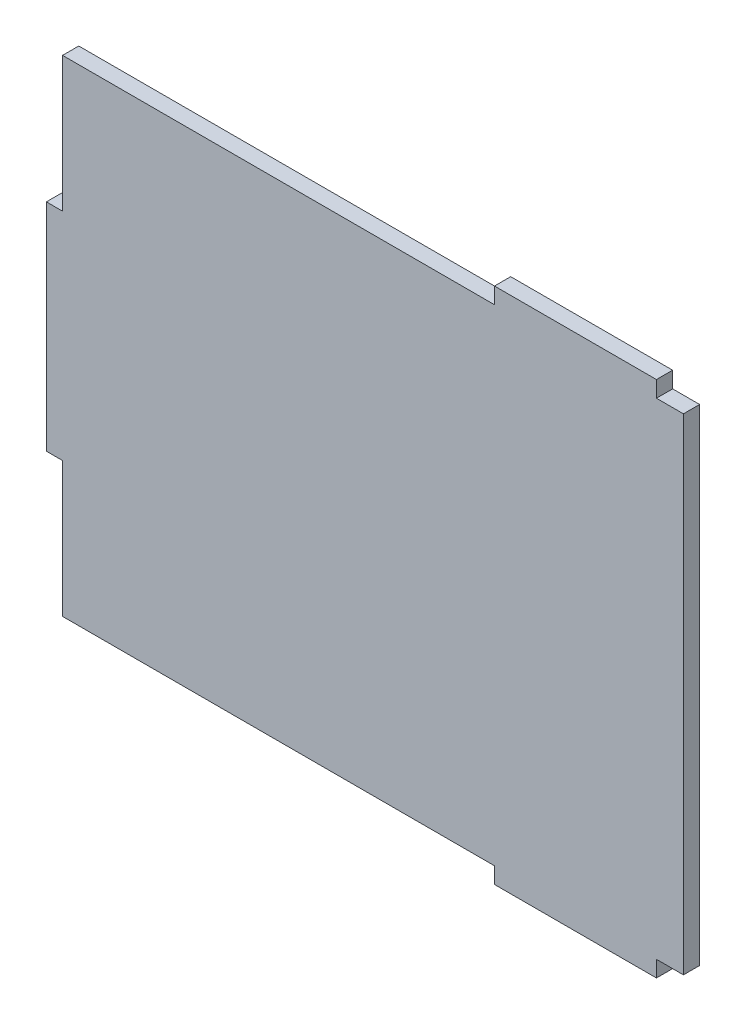
ISO-10303-21;
HEADER;
FILE_DESCRIPTION(('STEP AP214'),'2;1');
FILE_NAME('part.step','',(''),(''),'','','');
FILE_SCHEMA(('AUTOMOTIVE_DESIGN { 1 0 10303 214 1 1 1 1 }'));
ENDSEC;
DATA;
#1=APPLICATION_CONTEXT('core data for automotive mechanical design processes');
#2=APPLICATION_PROTOCOL_DEFINITION('international standard','automotive_design',2000,#1);
#3=PRODUCT_CONTEXT('',#1,'mechanical');
#4=PRODUCT('Part','Part','',(#3));
#5=PRODUCT_RELATED_PRODUCT_CATEGORY('part','',(#4));
#6=PRODUCT_DEFINITION_FORMATION('','',#4);
#7=PRODUCT_DEFINITION_CONTEXT('part definition',#1,'design');
#8=PRODUCT_DEFINITION('design','',#6,#7);
#9=PRODUCT_DEFINITION_SHAPE('','',#8);
#10=(LENGTH_UNIT() NAMED_UNIT(*) SI_UNIT(.MILLI.,.METRE.));
#11=(NAMED_UNIT(*) PLANE_ANGLE_UNIT() SI_UNIT($,.RADIAN.));
#12=(NAMED_UNIT(*) SI_UNIT($,.STERADIAN.) SOLID_ANGLE_UNIT());
#13=UNCERTAINTY_MEASURE_WITH_UNIT(LENGTH_MEASURE(1.E-05),#10,'distance_accuracy_value','');
#14=(GEOMETRIC_REPRESENTATION_CONTEXT(3) GLOBAL_UNCERTAINTY_ASSIGNED_CONTEXT((#13)) GLOBAL_UNIT_ASSIGNED_CONTEXT((#10,
#11,#12)) REPRESENTATION_CONTEXT('',''));
#15=CARTESIAN_POINT('',(0.,0.,0.));
#16=DIRECTION('',(0.,0.,1.));
#17=DIRECTION('',(1.,0.,0.));
#18=AXIS2_PLACEMENT_3D('',#15,#16,#17);
#19=CARTESIAN_POINT('',(22.5,-45.,3.));
#20=DIRECTION('',(0.,1.,0.));
#21=DIRECTION('',(-1.,0.,0.));
#22=AXIS2_PLACEMENT_3D('',#19,#20,#21);
#23=PLANE('',#22);
#24=DIRECTION('',(1.,0.,0.));
#25=VECTOR('',#24,1.);
#26=CARTESIAN_POINT('',(22.5,-45.,0.));
#27=LINE('',#26,#25);
#28=CARTESIAN_POINT('',(-57.5,-45.,0.));
#29=VERTEX_POINT('',#28);
#30=CARTESIAN_POINT('',(22.5,-45.,0.));
#31=VERTEX_POINT('',#30);
#32=EDGE_CURVE('E177',#29,#31,#27,.T.);
#33=ORIENTED_EDGE('',*,*,#32,.T.);
#34=DIRECTION('',(0.,0.,-1.));
#35=VECTOR('',#34,1.);
#36=CARTESIAN_POINT('',(22.5,-45.,3.));
#37=LINE('',#36,#35);
#38=CARTESIAN_POINT('',(22.5,-45.,3.));
#39=VERTEX_POINT('',#38);
#40=EDGE_CURVE('E11',#39,#31,#37,.T.);
#41=ORIENTED_EDGE('',*,*,#40,.F.);
#42=DIRECTION('',(1.,0.,0.));
#43=VECTOR('',#42,1.);
#44=CARTESIAN_POINT('',(22.5,-45.,3.));
#45=LINE('',#44,#43);
#46=CARTESIAN_POINT('',(-57.5,-45.,3.));
#47=VERTEX_POINT('',#46);
#48=EDGE_CURVE('E207',#47,#39,#45,.T.);
#49=ORIENTED_EDGE('',*,*,#48,.F.);
#50=DIRECTION('',(0.,0.,-1.));
#51=VECTOR('',#50,1.);
#52=CARTESIAN_POINT('',(-57.5,-45.,3.));
#53=LINE('',#52,#51);
#54=EDGE_CURVE('E173',#47,#29,#53,.T.);
#55=ORIENTED_EDGE('',*,*,#54,.T.);
#56=EDGE_LOOP('',(#33,#41,#49,#55));
#57=FACE_BOUND('',#56,.T.);
#58=ADVANCED_FACE('F33',(#57),#23,.F.);
#59=CARTESIAN_POINT('',(22.5,-48.,3.));
#60=DIRECTION('',(1.,0.,0.));
#61=DIRECTION('',(0.,0.,-1.));
#62=AXIS2_PLACEMENT_3D('',#59,#60,#61);
#63=PLANE('',#62);
#64=DIRECTION('',(0.,-1.,0.));
#65=VECTOR('',#64,1.);
#66=CARTESIAN_POINT('',(22.5,-48.,0.));
#67=LINE('',#66,#65);
#68=CARTESIAN_POINT('',(22.5,-48.,0.));
#69=VERTEX_POINT('',#68);
#70=EDGE_CURVE('E180',#31,#69,#67,.T.);
#71=ORIENTED_EDGE('',*,*,#70,.T.);
#72=DIRECTION('',(0.,0.,-1.));
#73=VECTOR('',#72,1.);
#74=CARTESIAN_POINT('',(22.5,-48.,3.));
#75=LINE('',#74,#73);
#76=CARTESIAN_POINT('',(22.5,-48.,3.));
#77=VERTEX_POINT('',#76);
#78=EDGE_CURVE('E41',#77,#69,#75,.T.);
#79=ORIENTED_EDGE('',*,*,#78,.F.);
#80=DIRECTION('',(0.,-1.,0.));
#81=VECTOR('',#80,1.);
#82=CARTESIAN_POINT('',(22.5,-48.,3.));
#83=LINE('',#82,#81);
#84=EDGE_CURVE('E116',#39,#77,#83,.T.);
#85=ORIENTED_EDGE('',*,*,#84,.F.);
#86=ORIENTED_EDGE('',*,*,#40,.T.);
#87=EDGE_LOOP('',(#71,#79,#85,#86));
#88=FACE_BOUND('',#87,.T.);
#89=ADVANCED_FACE('F305',(#88),#63,.F.);
#90=CARTESIAN_POINT('',(22.5,-48.,3.));
#91=DIRECTION('',(0.,1.,0.));
#92=DIRECTION('',(0.,0.,1.));
#93=AXIS2_PLACEMENT_3D('',#90,#91,#92);
#94=PLANE('',#93);
#95=DIRECTION('',(1.,0.,0.));
#96=VECTOR('',#95,1.);
#97=CARTESIAN_POINT('',(22.5,-48.,0.));
#98=LINE('',#97,#96);
#99=CARTESIAN_POINT('',(52.5,-48.,0.));
#100=VERTEX_POINT('',#99);
#101=EDGE_CURVE('E182',#69,#100,#98,.T.);
#102=ORIENTED_EDGE('',*,*,#101,.T.);
#103=DIRECTION('',(0.,0.,-1.));
#104=VECTOR('',#103,1.);
#105=CARTESIAN_POINT('',(52.5,-48.,3.));
#106=LINE('',#105,#104);
#107=CARTESIAN_POINT('',(52.5,-48.,3.));
#108=VERTEX_POINT('',#107);
#109=EDGE_CURVE('E238',#108,#100,#106,.T.);
#110=ORIENTED_EDGE('',*,*,#109,.F.);
#111=DIRECTION('',(1.,0.,0.));
#112=VECTOR('',#111,1.);
#113=CARTESIAN_POINT('',(22.5,-48.,3.));
#114=LINE('',#113,#112);
#115=EDGE_CURVE('E246',#77,#108,#114,.T.);
#116=ORIENTED_EDGE('',*,*,#115,.F.);
#117=ORIENTED_EDGE('',*,*,#78,.T.);
#118=EDGE_LOOP('',(#102,#110,#116,#117));
#119=FACE_BOUND('',#118,.T.);
#120=ADVANCED_FACE('F244',(#119),#94,.F.);
#121=CARTESIAN_POINT('',(52.5,-48.,3.));
#122=DIRECTION('',(-1.,0.,0.));
#123=DIRECTION('',(0.,0.,1.));
#124=AXIS2_PLACEMENT_3D('',#121,#122,#123);
#125=PLANE('',#124);
#126=DIRECTION('',(0.,1.,0.));
#127=VECTOR('',#126,1.);
#128=CARTESIAN_POINT('',(52.5,-48.,0.));
#129=LINE('',#128,#127);
#130=CARTESIAN_POINT('',(52.5,-45.,0.));
#131=VERTEX_POINT('',#130);
#132=EDGE_CURVE('E184',#100,#131,#129,.T.);
#133=ORIENTED_EDGE('',*,*,#132,.T.);
#134=DIRECTION('',(0.,0.,-1.));
#135=VECTOR('',#134,1.);
#136=CARTESIAN_POINT('',(52.5,-45.,3.));
#137=LINE('',#136,#135);
#138=CARTESIAN_POINT('',(52.5,-45.,3.));
#139=VERTEX_POINT('',#138);
#140=EDGE_CURVE('E235',#139,#131,#137,.T.);
#141=ORIENTED_EDGE('',*,*,#140,.F.);
#142=DIRECTION('',(0.,1.,0.));
#143=VECTOR('',#142,1.);
#144=CARTESIAN_POINT('',(52.5,-48.,3.));
#145=LINE('',#144,#143);
#146=EDGE_CURVE('E264',#108,#139,#145,.T.);
#147=ORIENTED_EDGE('',*,*,#146,.F.);
#148=ORIENTED_EDGE('',*,*,#109,.T.);
#149=EDGE_LOOP('',(#133,#141,#147,#148));
#150=FACE_BOUND('',#149,.T.);
#151=ADVANCED_FACE('F255',(#150),#125,.F.);
#152=CARTESIAN_POINT('',(57.5,-45.,3.));
#153=DIRECTION('',(0.,1.,0.));
#154=DIRECTION('',(0.,0.,1.));
#155=AXIS2_PLACEMENT_3D('',#152,#153,#154);
#156=PLANE('',#155);
#157=DIRECTION('',(1.,0.,0.));
#158=VECTOR('',#157,1.);
#159=CARTESIAN_POINT('',(57.5,-45.,0.));
#160=LINE('',#159,#158);
#161=CARTESIAN_POINT('',(57.5,-45.,0.));
#162=VERTEX_POINT('',#161);
#163=EDGE_CURVE('E186',#131,#162,#160,.T.);
#164=ORIENTED_EDGE('',*,*,#163,.T.);
#165=DIRECTION('',(0.,0.,-1.));
#166=VECTOR('',#165,1.);
#167=CARTESIAN_POINT('',(57.5,-45.,3.));
#168=LINE('',#167,#166);
#169=CARTESIAN_POINT('',(57.5,-45.,3.));
#170=VERTEX_POINT('',#169);
#171=EDGE_CURVE('E232',#170,#162,#168,.T.);
#172=ORIENTED_EDGE('',*,*,#171,.F.);
#173=DIRECTION('',(1.,0.,0.));
#174=VECTOR('',#173,1.);
#175=CARTESIAN_POINT('',(57.5,-45.,3.));
#176=LINE('',#175,#174);
#177=EDGE_CURVE('E261',#139,#170,#176,.T.);
#178=ORIENTED_EDGE('',*,*,#177,.F.);
#179=ORIENTED_EDGE('',*,*,#140,.T.);
#180=EDGE_LOOP('',(#164,#172,#178,#179));
#181=FACE_BOUND('',#180,.T.);
#182=ADVANCED_FACE('F259',(#181),#156,.F.);
#183=CARTESIAN_POINT('',(57.5,45.,3.));
#184=DIRECTION('',(-1.,0.,0.));
#185=DIRECTION('',(0.,-1.,0.));
#186=AXIS2_PLACEMENT_3D('',#183,#184,#185);
#187=PLANE('',#186);
#188=DIRECTION('',(0.,1.,0.));
#189=VECTOR('',#188,1.);
#190=CARTESIAN_POINT('',(57.5,45.,0.));
#191=LINE('',#190,#189);
#192=CARTESIAN_POINT('',(57.5,45.,0.));
#193=VERTEX_POINT('',#192);
#194=EDGE_CURVE('E188',#162,#193,#191,.T.);
#195=ORIENTED_EDGE('',*,*,#194,.T.);
#196=DIRECTION('',(0.,0.,-1.));
#197=VECTOR('',#196,1.);
#198=CARTESIAN_POINT('',(57.5,45.,3.));
#199=LINE('',#198,#197);
#200=CARTESIAN_POINT('',(57.5,45.,3.));
#201=VERTEX_POINT('',#200);
#202=EDGE_CURVE('E229',#201,#193,#199,.T.);
#203=ORIENTED_EDGE('',*,*,#202,.F.);
#204=DIRECTION('',(0.,1.,0.));
#205=VECTOR('',#204,1.);
#206=CARTESIAN_POINT('',(57.5,45.,3.));
#207=LINE('',#206,#205);
#208=EDGE_CURVE('E263',#170,#201,#207,.T.);
#209=ORIENTED_EDGE('',*,*,#208,.F.);
#210=ORIENTED_EDGE('',*,*,#171,.T.);
#211=EDGE_LOOP('',(#195,#203,#209,#210));
#212=FACE_BOUND('',#211,.T.);
#213=ADVANCED_FACE('F318',(#212),#187,.F.);
#214=CARTESIAN_POINT('',(57.5,45.,3.));
#215=DIRECTION('',(0.,-1.,0.));
#216=DIRECTION('',(0.,0.,-1.));
#217=AXIS2_PLACEMENT_3D('',#214,#215,#216);
#218=PLANE('',#217);
#219=DIRECTION('',(-1.,0.,0.));
#220=VECTOR('',#219,1.);
#221=CARTESIAN_POINT('',(57.5,45.,0.));
#222=LINE('',#221,#220);
#223=CARTESIAN_POINT('',(52.5,45.,0.));
#224=VERTEX_POINT('',#223);
#225=EDGE_CURVE('E190',#193,#224,#222,.T.);
#226=ORIENTED_EDGE('',*,*,#225,.T.);
#227=DIRECTION('',(0.,0.,-1.));
#228=VECTOR('',#227,1.);
#229=CARTESIAN_POINT('',(52.5,45.,3.));
#230=LINE('',#229,#228);
#231=CARTESIAN_POINT('',(52.5,45.,3.));
#232=VERTEX_POINT('',#231);
#233=EDGE_CURVE('E226',#232,#224,#230,.T.);
#234=ORIENTED_EDGE('',*,*,#233,.F.);
#235=DIRECTION('',(-1.,0.,0.));
#236=VECTOR('',#235,1.);
#237=CARTESIAN_POINT('',(57.5,45.,3.));
#238=LINE('',#237,#236);
#239=EDGE_CURVE('E266',#201,#232,#238,.T.);
#240=ORIENTED_EDGE('',*,*,#239,.F.);
#241=ORIENTED_EDGE('',*,*,#202,.T.);
#242=EDGE_LOOP('',(#226,#234,#240,#241));
#243=FACE_BOUND('',#242,.T.);
#244=ADVANCED_FACE('F321',(#243),#218,.F.);
#245=CARTESIAN_POINT('',(52.5,45.,3.));
#246=DIRECTION('',(-1.,0.,0.));
#247=DIRECTION('',(0.,-1.,0.));
#248=AXIS2_PLACEMENT_3D('',#245,#246,#247);
#249=PLANE('',#248);
#250=DIRECTION('',(0.,1.,0.));
#251=VECTOR('',#250,1.);
#252=CARTESIAN_POINT('',(52.5,45.,0.));
#253=LINE('',#252,#251);
#254=CARTESIAN_POINT('',(52.5,48.,0.));
#255=VERTEX_POINT('',#254);
#256=EDGE_CURVE('E192',#224,#255,#253,.T.);
#257=ORIENTED_EDGE('',*,*,#256,.T.);
#258=DIRECTION('',(0.,0.,-1.));
#259=VECTOR('',#258,1.);
#260=CARTESIAN_POINT('',(52.5,48.,3.));
#261=LINE('',#260,#259);
#262=CARTESIAN_POINT('',(52.5,48.,3.));
#263=VERTEX_POINT('',#262);
#264=EDGE_CURVE('E223',#263,#255,#261,.T.);
#265=ORIENTED_EDGE('',*,*,#264,.F.);
#266=DIRECTION('',(0.,1.,0.));
#267=VECTOR('',#266,1.);
#268=CARTESIAN_POINT('',(52.5,45.,3.));
#269=LINE('',#268,#267);
#270=EDGE_CURVE('E272',#232,#263,#269,.T.);
#271=ORIENTED_EDGE('',*,*,#270,.F.);
#272=ORIENTED_EDGE('',*,*,#233,.T.);
#273=EDGE_LOOP('',(#257,#265,#271,#272));
#274=FACE_BOUND('',#273,.T.);
#275=ADVANCED_FACE('F325',(#274),#249,.F.);
#276=CARTESIAN_POINT('',(22.5,48.,3.));
#277=DIRECTION('',(0.,-1.,0.));
#278=DIRECTION('',(0.,0.,-1.));
#279=AXIS2_PLACEMENT_3D('',#276,#277,#278);
#280=PLANE('',#279);
#281=DIRECTION('',(-1.,0.,0.));
#282=VECTOR('',#281,1.);
#283=CARTESIAN_POINT('',(22.5,48.,0.));
#284=LINE('',#283,#282);
#285=CARTESIAN_POINT('',(22.5,48.,0.));
#286=VERTEX_POINT('',#285);
#287=EDGE_CURVE('E194',#255,#286,#284,.T.);
#288=ORIENTED_EDGE('',*,*,#287,.T.);
#289=DIRECTION('',(0.,0.,-1.));
#290=VECTOR('',#289,1.);
#291=CARTESIAN_POINT('',(22.5,48.,3.));
#292=LINE('',#291,#290);
#293=CARTESIAN_POINT('',(22.5,48.,3.));
#294=VERTEX_POINT('',#293);
#295=EDGE_CURVE('E220',#294,#286,#292,.T.);
#296=ORIENTED_EDGE('',*,*,#295,.F.);
#297=DIRECTION('',(-1.,0.,0.));
#298=VECTOR('',#297,1.);
#299=CARTESIAN_POINT('',(22.5,48.,3.));
#300=LINE('',#299,#298);
#301=EDGE_CURVE('E274',#263,#294,#300,.T.);
#302=ORIENTED_EDGE('',*,*,#301,.F.);
#303=ORIENTED_EDGE('',*,*,#264,.T.);
#304=EDGE_LOOP('',(#288,#296,#302,#303));
#305=FACE_BOUND('',#304,.T.);
#306=ADVANCED_FACE('F329',(#305),#280,.F.);
#307=CARTESIAN_POINT('',(22.5,45.,3.));
#308=DIRECTION('',(1.,0.,0.));
#309=DIRECTION('',(0.,0.,-1.));
#310=AXIS2_PLACEMENT_3D('',#307,#308,#309);
#311=PLANE('',#310);
#312=DIRECTION('',(0.,-1.,0.));
#313=VECTOR('',#312,1.);
#314=CARTESIAN_POINT('',(22.5,45.,0.));
#315=LINE('',#314,#313);
#316=CARTESIAN_POINT('',(22.5,45.,0.));
#317=VERTEX_POINT('',#316);
#318=EDGE_CURVE('E196',#286,#317,#315,.T.);
#319=ORIENTED_EDGE('',*,*,#318,.T.);
#320=DIRECTION('',(0.,0.,-1.));
#321=VECTOR('',#320,1.);
#322=CARTESIAN_POINT('',(22.5,45.,3.));
#323=LINE('',#322,#321);
#324=CARTESIAN_POINT('',(22.5,45.,3.));
#325=VERTEX_POINT('',#324);
#326=EDGE_CURVE('E217',#325,#317,#323,.T.);
#327=ORIENTED_EDGE('',*,*,#326,.F.);
#328=DIRECTION('',(0.,-1.,0.));
#329=VECTOR('',#328,1.);
#330=CARTESIAN_POINT('',(22.5,45.,3.));
#331=LINE('',#330,#329);
#332=EDGE_CURVE('E276',#294,#325,#331,.T.);
#333=ORIENTED_EDGE('',*,*,#332,.F.);
#334=ORIENTED_EDGE('',*,*,#295,.T.);
#335=EDGE_LOOP('',(#319,#327,#333,#334));
#336=FACE_BOUND('',#335,.T.);
#337=ADVANCED_FACE('F333',(#336),#311,.F.);
#338=CARTESIAN_POINT('',(22.5,45.,3.));
#339=DIRECTION('',(0.,-1.,0.));
#340=DIRECTION('',(0.,0.,-1.));
#341=AXIS2_PLACEMENT_3D('',#338,#339,#340);
#342=PLANE('',#341);
#343=DIRECTION('',(-1.,0.,0.));
#344=VECTOR('',#343,1.);
#345=CARTESIAN_POINT('',(22.5,45.,0.));
#346=LINE('',#345,#344);
#347=CARTESIAN_POINT('',(-57.5,45.,0.));
#348=VERTEX_POINT('',#347);
#349=EDGE_CURVE('E198',#317,#348,#346,.T.);
#350=ORIENTED_EDGE('',*,*,#349,.T.);
#351=DIRECTION('',(0.,0.,-1.));
#352=VECTOR('',#351,1.);
#353=CARTESIAN_POINT('',(-57.5,45.,3.));
#354=LINE('',#353,#352);
#355=CARTESIAN_POINT('',(-57.5,45.,3.));
#356=VERTEX_POINT('',#355);
#357=EDGE_CURVE('E214',#356,#348,#354,.T.);
#358=ORIENTED_EDGE('',*,*,#357,.F.);
#359=DIRECTION('',(-1.,0.,0.));
#360=VECTOR('',#359,1.);
#361=CARTESIAN_POINT('',(22.5,45.,3.));
#362=LINE('',#361,#360);
#363=EDGE_CURVE('E278',#325,#356,#362,.T.);
#364=ORIENTED_EDGE('',*,*,#363,.F.);
#365=ORIENTED_EDGE('',*,*,#326,.T.);
#366=EDGE_LOOP('',(#350,#358,#364,#365));
#367=FACE_BOUND('',#366,.T.);
#368=ADVANCED_FACE('F337',(#367),#342,.F.);
#369=CARTESIAN_POINT('',(-57.5,45.,3.));
#370=DIRECTION('',(1.,0.,0.));
#371=DIRECTION('',(0.,1.,0.));
#372=AXIS2_PLACEMENT_3D('',#369,#370,#371);
#373=PLANE('',#372);
#374=DIRECTION('',(0.,-1.,0.));
#375=VECTOR('',#374,1.);
#376=CARTESIAN_POINT('',(-57.5,45.,0.));
#377=LINE('',#376,#375);
#378=CARTESIAN_POINT('',(-57.5,20.,0.));
#379=VERTEX_POINT('',#378);
#380=EDGE_CURVE('E200',#348,#379,#377,.T.);
#381=ORIENTED_EDGE('',*,*,#380,.T.);
#382=DIRECTION('',(0.,0.,-1.));
#383=VECTOR('',#382,1.);
#384=CARTESIAN_POINT('',(-57.5,20.,3.));
#385=LINE('',#384,#383);
#386=CARTESIAN_POINT('',(-57.5,20.,3.));
#387=VERTEX_POINT('',#386);
#388=EDGE_CURVE('E211',#387,#379,#385,.T.);
#389=ORIENTED_EDGE('',*,*,#388,.F.);
#390=DIRECTION('',(0.,-1.,0.));
#391=VECTOR('',#390,1.);
#392=CARTESIAN_POINT('',(-57.5,45.,3.));
#393=LINE('',#392,#391);
#394=EDGE_CURVE('E280',#356,#387,#393,.T.);
#395=ORIENTED_EDGE('',*,*,#394,.F.);
#396=ORIENTED_EDGE('',*,*,#357,.T.);
#397=EDGE_LOOP('',(#381,#389,#395,#396));
#398=FACE_BOUND('',#397,.T.);
#399=ADVANCED_FACE('F286',(#398),#373,.F.);
#400=CARTESIAN_POINT('',(-60.5,20.,3.));
#401=DIRECTION('',(0.,-1.,0.));
#402=DIRECTION('',(0.,0.,-1.));
#403=AXIS2_PLACEMENT_3D('',#400,#401,#402);
#404=PLANE('',#403);
#405=DIRECTION('',(-1.,0.,0.));
#406=VECTOR('',#405,1.);
#407=CARTESIAN_POINT('',(-60.5,20.,0.));
#408=LINE('',#407,#406);
#409=CARTESIAN_POINT('',(-60.5,20.,0.));
#410=VERTEX_POINT('',#409);
#411=EDGE_CURVE('E202',#379,#410,#408,.T.);
#412=ORIENTED_EDGE('',*,*,#411,.T.);
#413=DIRECTION('',(0.,0.,-1.));
#414=VECTOR('',#413,1.);
#415=CARTESIAN_POINT('',(-60.5,20.,3.));
#416=LINE('',#415,#414);
#417=CARTESIAN_POINT('',(-60.5,20.,3.));
#418=VERTEX_POINT('',#417);
#419=EDGE_CURVE('E168',#418,#410,#416,.T.);
#420=ORIENTED_EDGE('',*,*,#419,.F.);
#421=DIRECTION('',(-1.,0.,0.));
#422=VECTOR('',#421,1.);
#423=CARTESIAN_POINT('',(-60.5,20.,3.));
#424=LINE('',#423,#422);
#425=EDGE_CURVE('E159',#387,#418,#424,.T.);
#426=ORIENTED_EDGE('',*,*,#425,.F.);
#427=ORIENTED_EDGE('',*,*,#388,.T.);
#428=EDGE_LOOP('',(#412,#420,#426,#427));
#429=FACE_BOUND('',#428,.T.);
#430=ADVANCED_FACE('F290',(#429),#404,.F.);
#431=CARTESIAN_POINT('',(-60.5,-20.,3.));
#432=DIRECTION('',(1.,0.,0.));
#433=DIRECTION('',(0.,0.,-1.));
#434=AXIS2_PLACEMENT_3D('',#431,#432,#433);
#435=PLANE('',#434);
#436=DIRECTION('',(0.,-1.,0.));
#437=VECTOR('',#436,1.);
#438=CARTESIAN_POINT('',(-60.5,-20.,0.));
#439=LINE('',#438,#437);
#440=CARTESIAN_POINT('',(-60.5,-20.,0.));
#441=VERTEX_POINT('',#440);
#442=EDGE_CURVE('E167',#410,#441,#439,.T.);
#443=ORIENTED_EDGE('',*,*,#442,.T.);
#444=DIRECTION('',(0.,0.,-1.));
#445=VECTOR('',#444,1.);
#446=CARTESIAN_POINT('',(-60.5,-20.,3.));
#447=LINE('',#446,#445);
#448=CARTESIAN_POINT('',(-60.5,-20.,3.));
#449=VERTEX_POINT('',#448);
#450=EDGE_CURVE('E164',#449,#441,#447,.T.);
#451=ORIENTED_EDGE('',*,*,#450,.F.);
#452=DIRECTION('',(0.,-1.,0.));
#453=VECTOR('',#452,1.);
#454=CARTESIAN_POINT('',(-60.5,-20.,3.));
#455=LINE('',#454,#453);
#456=EDGE_CURVE('E153',#418,#449,#455,.T.);
#457=ORIENTED_EDGE('',*,*,#456,.F.);
#458=ORIENTED_EDGE('',*,*,#419,.T.);
#459=EDGE_LOOP('',(#443,#451,#457,#458));
#460=FACE_BOUND('',#459,.T.);
#461=ADVANCED_FACE('F165',(#460),#435,.F.);
#462=CARTESIAN_POINT('',(-60.5,-20.,3.));
#463=DIRECTION('',(0.,1.,0.));
#464=DIRECTION('',(0.,0.,1.));
#465=AXIS2_PLACEMENT_3D('',#462,#463,#464);
#466=PLANE('',#465);
#467=DIRECTION('',(1.,0.,0.));
#468=VECTOR('',#467,1.);
#469=CARTESIAN_POINT('',(-60.5,-20.,0.));
#470=LINE('',#469,#468);
#471=CARTESIAN_POINT('',(-57.5,-20.,0.));
#472=VERTEX_POINT('',#471);
#473=EDGE_CURVE('E102',#441,#472,#470,.T.);
#474=ORIENTED_EDGE('',*,*,#473,.T.);
#475=DIRECTION('',(0.,0.,-1.));
#476=VECTOR('',#475,1.);
#477=CARTESIAN_POINT('',(-57.5,-20.,3.));
#478=LINE('',#477,#476);
#479=CARTESIAN_POINT('',(-57.5,-20.,3.));
#480=VERTEX_POINT('',#479);
#481=EDGE_CURVE('E169',#480,#472,#478,.T.);
#482=ORIENTED_EDGE('',*,*,#481,.F.);
#483=DIRECTION('',(1.,0.,0.));
#484=VECTOR('',#483,1.);
#485=CARTESIAN_POINT('',(-60.5,-20.,3.));
#486=LINE('',#485,#484);
#487=EDGE_CURVE('E157',#449,#480,#486,.T.);
#488=ORIENTED_EDGE('',*,*,#487,.F.);
#489=ORIENTED_EDGE('',*,*,#450,.T.);
#490=EDGE_LOOP('',(#474,#482,#488,#489));
#491=FACE_BOUND('',#490,.T.);
#492=ADVANCED_FACE('F171',(#491),#466,.F.);
#493=CARTESIAN_POINT('',(-57.5,-20.,3.));
#494=DIRECTION('',(1.,0.,0.));
#495=DIRECTION('',(0.,1.,0.));
#496=AXIS2_PLACEMENT_3D('',#493,#494,#495);
#497=PLANE('',#496);
#498=DIRECTION('',(0.,-1.,0.));
#499=VECTOR('',#498,1.);
#500=CARTESIAN_POINT('',(-57.5,-20.,0.));
#501=LINE('',#500,#499);
#502=EDGE_CURVE('E108',#472,#29,#501,.T.);
#503=ORIENTED_EDGE('',*,*,#502,.T.);
#504=ORIENTED_EDGE('',*,*,#54,.F.);
#505=DIRECTION('',(0.,-1.,0.));
#506=VECTOR('',#505,1.);
#507=CARTESIAN_POINT('',(-57.5,-20.,3.));
#508=LINE('',#507,#506);
#509=EDGE_CURVE('E49',#480,#47,#508,.T.);
#510=ORIENTED_EDGE('',*,*,#509,.F.);
#511=ORIENTED_EDGE('',*,*,#481,.T.);
#512=EDGE_LOOP('',(#503,#504,#510,#511));
#513=FACE_BOUND('',#512,.T.);
#514=ADVANCED_FACE('F294',(#513),#497,.F.);
#515=CARTESIAN_POINT('',(0.,0.,3.));
#516=DIRECTION('',(0.,0.,1.));
#517=DIRECTION('',(1.,0.,0.));
#518=AXIS2_PLACEMENT_3D('',#515,#516,#517);
#519=PLANE('',#518);
#520=ORIENTED_EDGE('',*,*,#48,.T.);
#521=ORIENTED_EDGE('',*,*,#84,.T.);
#522=ORIENTED_EDGE('',*,*,#115,.T.);
#523=ORIENTED_EDGE('',*,*,#146,.T.);
#524=ORIENTED_EDGE('',*,*,#177,.T.);
#525=ORIENTED_EDGE('',*,*,#208,.T.);
#526=ORIENTED_EDGE('',*,*,#239,.T.);
#527=ORIENTED_EDGE('',*,*,#270,.T.);
#528=ORIENTED_EDGE('',*,*,#301,.T.);
#529=ORIENTED_EDGE('',*,*,#332,.T.);
#530=ORIENTED_EDGE('',*,*,#363,.T.);
#531=ORIENTED_EDGE('',*,*,#394,.T.);
#532=ORIENTED_EDGE('',*,*,#425,.T.);
#533=ORIENTED_EDGE('',*,*,#456,.T.);
#534=ORIENTED_EDGE('',*,*,#487,.T.);
#535=ORIENTED_EDGE('',*,*,#509,.T.);
#536=EDGE_LOOP('',(#520,#521,#522,#523,#524,#525,#526,#527,#528,#529,#530,#531,#532,#533,#534,#535));
#537=FACE_BOUND('',#536,.T.);
#538=ADVANCED_FACE('F155',(#537),#519,.T.);
#539=CARTESIAN_POINT('',(0.,0.,0.));
#540=DIRECTION('',(0.,0.,1.));
#541=DIRECTION('',(1.,0.,0.));
#542=AXIS2_PLACEMENT_3D('',#539,#540,#541);
#543=PLANE('',#542);
#544=ORIENTED_EDGE('',*,*,#32,.F.);
#545=ORIENTED_EDGE('',*,*,#502,.F.);
#546=ORIENTED_EDGE('',*,*,#473,.F.);
#547=ORIENTED_EDGE('',*,*,#442,.F.);
#548=ORIENTED_EDGE('',*,*,#411,.F.);
#549=ORIENTED_EDGE('',*,*,#380,.F.);
#550=ORIENTED_EDGE('',*,*,#349,.F.);
#551=ORIENTED_EDGE('',*,*,#318,.F.);
#552=ORIENTED_EDGE('',*,*,#287,.F.);
#553=ORIENTED_EDGE('',*,*,#256,.F.);
#554=ORIENTED_EDGE('',*,*,#225,.F.);
#555=ORIENTED_EDGE('',*,*,#194,.F.);
#556=ORIENTED_EDGE('',*,*,#163,.F.);
#557=ORIENTED_EDGE('',*,*,#132,.F.);
#558=ORIENTED_EDGE('',*,*,#101,.F.);
#559=ORIENTED_EDGE('',*,*,#70,.F.);
#560=EDGE_LOOP('',(#544,#545,#546,#547,#548,#549,#550,#551,#552,#553,#554,#555,#556,#557,#558,#559));
#561=FACE_BOUND('',#560,.T.);
#562=ADVANCED_FACE('F250',(#561),#543,.F.);
#563=CLOSED_SHELL('',(#58,#89,#120,#151,#182,#213,#244,#275,#306,#337,#368,#399,#430,#461,#492,
#514,#538,#562));
#564=MANIFOLD_SOLID_BREP('B2',#563);
#565=ADVANCED_BREP_SHAPE_REPRESENTATION('',(#18,#564),#14);
#566=SHAPE_DEFINITION_REPRESENTATION(#9,#565);
ENDSEC;
END-ISO-10303-21;
